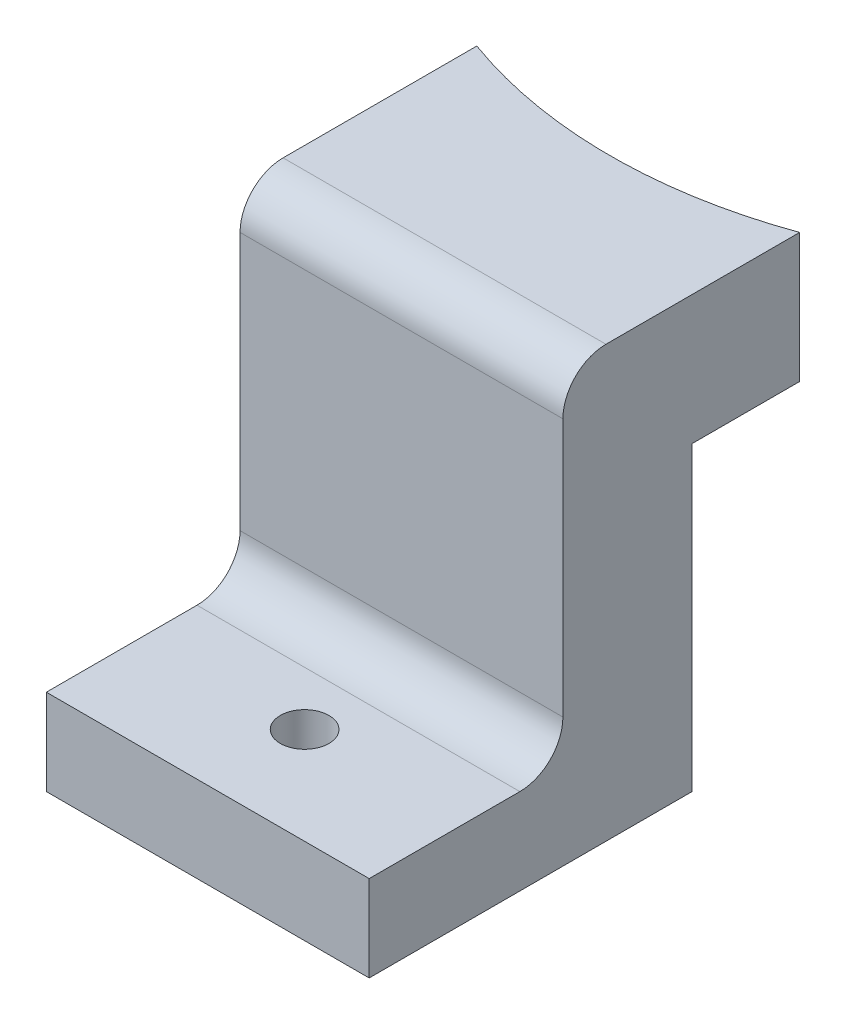
ISO-10303-21;
HEADER;
FILE_DESCRIPTION(('STEP AP214'),'2;1');
FILE_NAME('part.step','',(''),(''),'','','');
FILE_SCHEMA(('AUTOMOTIVE_DESIGN { 1 0 10303 214 1 1 1 1 }'));
ENDSEC;
DATA;
#1=APPLICATION_CONTEXT('core data for automotive mechanical design processes');
#2=APPLICATION_PROTOCOL_DEFINITION('international standard','automotive_design',2000,#1);
#3=PRODUCT_CONTEXT('',#1,'mechanical');
#4=PRODUCT('Part','Part','',(#3));
#5=PRODUCT_RELATED_PRODUCT_CATEGORY('part','',(#4));
#6=PRODUCT_DEFINITION_FORMATION('','',#4);
#7=PRODUCT_DEFINITION_CONTEXT('part definition',#1,'design');
#8=PRODUCT_DEFINITION('design','',#6,#7);
#9=PRODUCT_DEFINITION_SHAPE('','',#8);
#10=(LENGTH_UNIT() NAMED_UNIT(*) SI_UNIT(.MILLI.,.METRE.));
#11=(NAMED_UNIT(*) PLANE_ANGLE_UNIT() SI_UNIT($,.RADIAN.));
#12=(NAMED_UNIT(*) SI_UNIT($,.STERADIAN.) SOLID_ANGLE_UNIT());
#13=UNCERTAINTY_MEASURE_WITH_UNIT(LENGTH_MEASURE(1.E-05),#10,'distance_accuracy_value','');
#14=(GEOMETRIC_REPRESENTATION_CONTEXT(3) GLOBAL_UNCERTAINTY_ASSIGNED_CONTEXT((#13)) GLOBAL_UNIT_ASSIGNED_CONTEXT((#10,
#11,#12)) REPRESENTATION_CONTEXT('',''));
#15=CARTESIAN_POINT('',(0.,0.,0.));
#16=DIRECTION('',(0.,0.,1.));
#17=DIRECTION('',(1.,0.,0.));
#18=AXIS2_PLACEMENT_3D('',#15,#16,#17);
#19=CARTESIAN_POINT('',(-7.5,6.,-5.));
#20=DIRECTION('',(1.,0.,0.));
#21=DIRECTION('',(0.,0.,-1.));
#22=AXIS2_PLACEMENT_3D('',#19,#20,#21);
#23=PLANE('',#22);
#24=DIRECTION('',(0.,1.,0.));
#25=VECTOR('',#24,1.);
#26=CARTESIAN_POINT('',(-7.50000000000001,-14.,6.));
#27=LINE('',#26,#25);
#28=CARTESIAN_POINT('',(-7.50000000000001,-8.,6.));
#29=VERTEX_POINT('',#28);
#30=CARTESIAN_POINT('',(-7.50000000000001,4.,6.));
#31=VERTEX_POINT('',#30);
#32=EDGE_CURVE('E156',#29,#31,#27,.T.);
#33=ORIENTED_EDGE('',*,*,#32,.T.);
#34=CARTESIAN_POINT('',(-7.5,4.,4.));
#35=DIRECTION('',(1.,0.,0.));
#36=DIRECTION('',(0.,0.,-1.));
#37=AXIS2_PLACEMENT_3D('',#34,#35,#36);
#38=CIRCLE('',#37,2.);
#39=CARTESIAN_POINT('',(-7.5,6.,4.));
#40=VERTEX_POINT('',#39);
#41=EDGE_CURVE('E60',#31,#40,#38,.F.);
#42=ORIENTED_EDGE('',*,*,#41,.T.);
#43=DIRECTION('',(0.,0.,1.));
#44=VECTOR('',#43,1.);
#45=CARTESIAN_POINT('',(-7.5,6.,-5.));
#46=LINE('',#45,#44);
#47=CARTESIAN_POINT('',(-7.5,6.,-5.));
#48=VERTEX_POINT('',#47);
#49=EDGE_CURVE('E168',#48,#40,#46,.T.);
#50=ORIENTED_EDGE('',*,*,#49,.F.);
#51=DIRECTION('',(0.,-1.,0.));
#52=VECTOR('',#51,1.);
#53=CARTESIAN_POINT('',(-7.5,6.,-5.));
#54=LINE('',#53,#52);
#55=CARTESIAN_POINT('',(-7.5,0.,-5.));
#56=VERTEX_POINT('',#55);
#57=EDGE_CURVE('E173',#48,#56,#54,.T.);
#58=ORIENTED_EDGE('',*,*,#57,.T.);
#59=DIRECTION('',(0.,0.,1.));
#60=VECTOR('',#59,1.);
#61=CARTESIAN_POINT('',(-7.5,0.,-5.));
#62=LINE('',#61,#60);
#63=CARTESIAN_POINT('',(-7.50000000000001,0.,0.));
#64=VERTEX_POINT('',#63);
#65=EDGE_CURVE('E167',#56,#64,#62,.T.);
#66=ORIENTED_EDGE('',*,*,#65,.T.);
#67=DIRECTION('',(0.,1.,0.));
#68=VECTOR('',#67,1.);
#69=CARTESIAN_POINT('',(-7.50000000000001,-14.,0.));
#70=LINE('',#69,#68);
#71=CARTESIAN_POINT('',(-7.50000000000001,-14.,0.));
#72=VERTEX_POINT('',#71);
#73=EDGE_CURVE('E121',#72,#64,#70,.T.);
#74=ORIENTED_EDGE('',*,*,#73,.F.);
#75=DIRECTION('',(0.,0.,1.));
#76=VECTOR('',#75,1.);
#77=CARTESIAN_POINT('',(-7.50000000000001,-14.,0.));
#78=LINE('',#77,#76);
#79=CARTESIAN_POINT('',(-7.50000000000001,-14.,15.));
#80=VERTEX_POINT('',#79);
#81=EDGE_CURVE('E115',#72,#80,#78,.T.);
#82=ORIENTED_EDGE('',*,*,#81,.T.);
#83=DIRECTION('',(0.,-1.,0.));
#84=VECTOR('',#83,1.);
#85=CARTESIAN_POINT('',(-7.50000000000001,-10.,15.));
#86=LINE('',#85,#84);
#87=CARTESIAN_POINT('',(-7.50000000000001,-10.,15.));
#88=VERTEX_POINT('',#87);
#89=EDGE_CURVE('E119',#88,#80,#86,.T.);
#90=ORIENTED_EDGE('',*,*,#89,.F.);
#91=DIRECTION('',(0.,0.,-1.));
#92=VECTOR('',#91,1.);
#93=CARTESIAN_POINT('',(-7.50000000000001,-10.,15.));
#94=LINE('',#93,#92);
#95=CARTESIAN_POINT('',(-7.50000000000001,-10.,8.));
#96=VERTEX_POINT('',#95);
#97=EDGE_CURVE('E149',#88,#96,#94,.T.);
#98=ORIENTED_EDGE('',*,*,#97,.T.);
#99=CARTESIAN_POINT('',(-7.5,-8.,8.));
#100=DIRECTION('',(1.,0.,0.));
#101=DIRECTION('',(0.,0.,-1.));
#102=AXIS2_PLACEMENT_3D('',#99,#100,#101);
#103=CIRCLE('',#102,2.);
#104=EDGE_CURVE('E45',#96,#29,#103,.T.);
#105=ORIENTED_EDGE('',*,*,#104,.T.);
#106=EDGE_LOOP('',(#33,#42,#50,#58,#66,#74,#82,#90,#98,#105));
#107=FACE_BOUND('',#106,.T.);
#108=ADVANCED_FACE('F37',(#107),#23,.F.);
#109=CARTESIAN_POINT('',(7.5,6.,-5.));
#110=DIRECTION('',(-1.,0.,0.));
#111=DIRECTION('',(0.,0.,1.));
#112=AXIS2_PLACEMENT_3D('',#109,#110,#111);
#113=PLANE('',#112);
#114=DIRECTION('',(0.,0.,-1.));
#115=VECTOR('',#114,1.);
#116=CARTESIAN_POINT('',(7.5,6.,-5.));
#117=LINE('',#116,#115);
#118=CARTESIAN_POINT('',(7.5,6.,4.));
#119=VERTEX_POINT('',#118);
#120=CARTESIAN_POINT('',(7.5,6.,-5.));
#121=VERTEX_POINT('',#120);
#122=EDGE_CURVE('E170',#119,#121,#117,.T.);
#123=ORIENTED_EDGE('',*,*,#122,.F.);
#124=CARTESIAN_POINT('',(7.5,4.,4.));
#125=DIRECTION('',(-1.,0.,0.));
#126=DIRECTION('',(0.,0.,1.));
#127=AXIS2_PLACEMENT_3D('',#124,#125,#126);
#128=CIRCLE('',#127,2.);
#129=CARTESIAN_POINT('',(7.5,4.,6.));
#130=VERTEX_POINT('',#129);
#131=EDGE_CURVE('E52',#119,#130,#128,.F.);
#132=ORIENTED_EDGE('',*,*,#131,.T.);
#133=DIRECTION('',(0.,1.,0.));
#134=VECTOR('',#133,1.);
#135=CARTESIAN_POINT('',(7.5,-14.,6.));
#136=LINE('',#135,#134);
#137=CARTESIAN_POINT('',(7.5,-8.,6.));
#138=VERTEX_POINT('',#137);
#139=EDGE_CURVE('E161',#138,#130,#136,.T.);
#140=ORIENTED_EDGE('',*,*,#139,.F.);
#141=CARTESIAN_POINT('',(7.5,-8.,8.));
#142=DIRECTION('',(-1.,0.,0.));
#143=DIRECTION('',(0.,0.,1.));
#144=AXIS2_PLACEMENT_3D('',#141,#142,#143);
#145=CIRCLE('',#144,2.);
#146=CARTESIAN_POINT('',(7.5,-10.,8.));
#147=VERTEX_POINT('',#146);
#148=EDGE_CURVE('E11',#138,#147,#145,.T.);
#149=ORIENTED_EDGE('',*,*,#148,.T.);
#150=DIRECTION('',(0.,0.,-1.));
#151=VECTOR('',#150,1.);
#152=CARTESIAN_POINT('',(7.5,-10.,15.));
#153=LINE('',#152,#151);
#154=CARTESIAN_POINT('',(7.5,-10.,15.));
#155=VERTEX_POINT('',#154);
#156=EDGE_CURVE('E126',#155,#147,#153,.T.);
#157=ORIENTED_EDGE('',*,*,#156,.F.);
#158=DIRECTION('',(0.,1.,0.));
#159=VECTOR('',#158,1.);
#160=CARTESIAN_POINT('',(7.5,-10.,15.));
#161=LINE('',#160,#159);
#162=CARTESIAN_POINT('',(7.5,-14.,15.));
#163=VERTEX_POINT('',#162);
#164=EDGE_CURVE('E134',#163,#155,#161,.T.);
#165=ORIENTED_EDGE('',*,*,#164,.F.);
#166=DIRECTION('',(0.,0.,-1.));
#167=VECTOR('',#166,1.);
#168=CARTESIAN_POINT('',(7.5,-14.,0.));
#169=LINE('',#168,#167);
#170=CARTESIAN_POINT('',(7.5,-14.,0.));
#171=VERTEX_POINT('',#170);
#172=EDGE_CURVE('E125',#163,#171,#169,.T.);
#173=ORIENTED_EDGE('',*,*,#172,.T.);
#174=DIRECTION('',(0.,1.,0.));
#175=VECTOR('',#174,1.);
#176=CARTESIAN_POINT('',(7.5,-14.,0.));
#177=LINE('',#176,#175);
#178=CARTESIAN_POINT('',(7.5,0.,0.));
#179=VERTEX_POINT('',#178);
#180=EDGE_CURVE('E159',#171,#179,#177,.T.);
#181=ORIENTED_EDGE('',*,*,#180,.T.);
#182=DIRECTION('',(0.,0.,-1.));
#183=VECTOR('',#182,1.);
#184=CARTESIAN_POINT('',(7.5,0.,-5.));
#185=LINE('',#184,#183);
#186=CARTESIAN_POINT('',(7.5,0.,-5.));
#187=VERTEX_POINT('',#186);
#188=EDGE_CURVE('E171',#179,#187,#185,.T.);
#189=ORIENTED_EDGE('',*,*,#188,.T.);
#190=DIRECTION('',(0.,-1.,0.));
#191=VECTOR('',#190,1.);
#192=CARTESIAN_POINT('',(7.5,6.,-5.));
#193=LINE('',#192,#191);
#194=EDGE_CURVE('E178',#121,#187,#193,.T.);
#195=ORIENTED_EDGE('',*,*,#194,.F.);
#196=EDGE_LOOP('',(#123,#132,#140,#149,#157,#165,#173,#181,#189,#195));
#197=FACE_BOUND('',#196,.T.);
#198=ADVANCED_FACE('F209',(#197),#113,.F.);
#199=CARTESIAN_POINT('',(0.,6.,0.));
#200=DIRECTION('',(0.,1.,0.));
#201=DIRECTION('',(0.,0.,1.));
#202=AXIS2_PLACEMENT_3D('',#199,#200,#201);
#203=PLANE('',#202);
#204=ORIENTED_EDGE('',*,*,#49,.T.);
#205=DIRECTION('',(1.,0.,0.));
#206=VECTOR('',#205,1.);
#207=CARTESIAN_POINT('',(0.,6.,4.));
#208=LINE('',#207,#206);
#209=EDGE_CURVE('E194',#40,#119,#208,.T.);
#210=ORIENTED_EDGE('',*,*,#209,.T.);
#211=ORIENTED_EDGE('',*,*,#122,.T.);
#212=CARTESIAN_POINT('',(0.,6.,-25.6821178799464));
#213=DIRECTION('',(0.,1.,0.));
#214=DIRECTION('',(0.,0.,1.));
#215=AXIS2_PLACEMENT_3D('',#212,#213,#214);
#216=CIRCLE('',#215,22.);
#217=EDGE_CURVE('E158',#48,#121,#216,.T.);
#218=ORIENTED_EDGE('',*,*,#217,.F.);
#219=EDGE_LOOP('',(#204,#210,#211,#218));
#220=FACE_BOUND('',#219,.T.);
#221=ADVANCED_FACE('F228',(#220),#203,.T.);
#222=CARTESIAN_POINT('',(0.,0.,0.));
#223=DIRECTION('',(0.,1.,0.));
#224=DIRECTION('',(0.,0.,1.));
#225=AXIS2_PLACEMENT_3D('',#222,#223,#224);
#226=PLANE('',#225);
#227=ORIENTED_EDGE('',*,*,#188,.F.);
#228=DIRECTION('',(-1.,0.,0.));
#229=VECTOR('',#228,1.);
#230=CARTESIAN_POINT('',(0.,0.,0.));
#231=LINE('',#230,#229);
#232=EDGE_CURVE('E184',#179,#64,#231,.T.);
#233=ORIENTED_EDGE('',*,*,#232,.T.);
#234=ORIENTED_EDGE('',*,*,#65,.F.);
#235=CARTESIAN_POINT('',(0.,0.,-25.6821178799464));
#236=DIRECTION('',(0.,1.,0.));
#237=DIRECTION('',(0.,0.,1.));
#238=AXIS2_PLACEMENT_3D('',#235,#236,#237);
#239=CIRCLE('',#238,22.);
#240=EDGE_CURVE('E181',#56,#187,#239,.T.);
#241=ORIENTED_EDGE('',*,*,#240,.T.);
#242=EDGE_LOOP('',(#227,#233,#234,#241));
#243=FACE_BOUND('',#242,.T.);
#244=ADVANCED_FACE('F293',(#243),#226,.F.);
#245=CARTESIAN_POINT('',(0.,-3.,-25.6821178799464));
#246=DIRECTION('',(0.,1.,0.));
#247=DIRECTION('',(0.,0.,1.));
#248=AXIS2_PLACEMENT_3D('',#245,#246,#247);
#249=CYLINDRICAL_SURFACE('',#248,22.);
#250=ORIENTED_EDGE('',*,*,#240,.F.);
#251=ORIENTED_EDGE('',*,*,#57,.F.);
#252=ORIENTED_EDGE('',*,*,#217,.T.);
#253=ORIENTED_EDGE('',*,*,#194,.T.);
#254=EDGE_LOOP('',(#250,#251,#252,#253));
#255=FACE_BOUND('',#254,.T.);
#256=ADVANCED_FACE('F324',(#255),#249,.F.);
#257=CARTESIAN_POINT('',(-7.50000000000001,-14.,0.));
#258=DIRECTION('',(0.,0.,-1.));
#259=DIRECTION('',(-1.,0.,0.));
#260=AXIS2_PLACEMENT_3D('',#257,#258,#259);
#261=PLANE('',#260);
#262=ORIENTED_EDGE('',*,*,#232,.F.);
#263=ORIENTED_EDGE('',*,*,#180,.F.);
#264=DIRECTION('',(-1.,0.,0.));
#265=VECTOR('',#264,1.);
#266=CARTESIAN_POINT('',(-7.50000000000001,-14.,0.));
#267=LINE('',#266,#265);
#268=EDGE_CURVE('E154',#171,#72,#267,.T.);
#269=ORIENTED_EDGE('',*,*,#268,.T.);
#270=ORIENTED_EDGE('',*,*,#73,.T.);
#271=EDGE_LOOP('',(#262,#263,#269,#270));
#272=FACE_BOUND('',#271,.T.);
#273=ADVANCED_FACE('F257',(#272),#261,.T.);
#274=CARTESIAN_POINT('',(-7.50000000000001,-14.,6.));
#275=DIRECTION('',(0.,0.,1.));
#276=DIRECTION('',(1.,0.,0.));
#277=AXIS2_PLACEMENT_3D('',#274,#275,#276);
#278=PLANE('',#277);
#279=ORIENTED_EDGE('',*,*,#32,.F.);
#280=DIRECTION('',(-1.,0.,0.));
#281=VECTOR('',#280,1.);
#282=CARTESIAN_POINT('',(-7.50000000000001,-8.,6.));
#283=LINE('',#282,#281);
#284=EDGE_CURVE('E192',#29,#138,#283,.F.);
#285=ORIENTED_EDGE('',*,*,#284,.T.);
#286=ORIENTED_EDGE('',*,*,#139,.T.);
#287=DIRECTION('',(1.,0.,0.));
#288=VECTOR('',#287,1.);
#289=CARTESIAN_POINT('',(-7.50000000000001,4.,6.));
#290=LINE('',#289,#288);
#291=EDGE_CURVE('E190',#130,#31,#290,.F.);
#292=ORIENTED_EDGE('',*,*,#291,.T.);
#293=EDGE_LOOP('',(#279,#285,#286,#292));
#294=FACE_BOUND('',#293,.T.);
#295=ADVANCED_FACE('F202',(#294),#278,.T.);
#296=CARTESIAN_POINT('',(0.,-14.,0.));
#297=DIRECTION('',(0.,1.,0.));
#298=DIRECTION('',(0.,0.,1.));
#299=AXIS2_PLACEMENT_3D('',#296,#297,#298);
#300=PLANE('',#299);
#301=CARTESIAN_POINT('',(0.,-14.,10.5));
#302=DIRECTION('',(0.,-1.,0.));
#303=DIRECTION('',(0.,0.,-1.));
#304=AXIS2_PLACEMENT_3D('',#301,#302,#303);
#305=CIRCLE('',#304,1.13029999999999);
#306=CARTESIAN_POINT('',(0.,-14.,9.36970000000001));
#307=VERTEX_POINT('',#306);
#308=EDGE_CURVE('E143',#307,#307,#305,.T.);
#309=ORIENTED_EDGE('',*,*,#308,.F.);
#310=EDGE_LOOP('',(#309));
#311=FACE_BOUND('',#310,.T.);
#312=ORIENTED_EDGE('',*,*,#81,.F.);
#313=ORIENTED_EDGE('',*,*,#268,.F.);
#314=ORIENTED_EDGE('',*,*,#172,.F.);
#315=DIRECTION('',(1.,0.,0.));
#316=VECTOR('',#315,1.);
#317=CARTESIAN_POINT('',(-7.50000000000001,-14.,15.));
#318=LINE('',#317,#316);
#319=EDGE_CURVE('E129',#80,#163,#318,.T.);
#320=ORIENTED_EDGE('',*,*,#319,.F.);
#321=EDGE_LOOP('',(#312,#313,#314,#320));
#322=FACE_BOUND('',#321,.T.);
#323=ADVANCED_FACE('F130',(#311,#322),#300,.F.);
#324=CARTESIAN_POINT('',(-7.50000000000001,-10.,15.));
#325=DIRECTION('',(0.,-1.,0.));
#326=DIRECTION('',(0.,0.,-1.));
#327=AXIS2_PLACEMENT_3D('',#324,#325,#326);
#328=PLANE('',#327);
#329=CARTESIAN_POINT('',(0.,-10.,10.5));
#330=DIRECTION('',(0.,-1.,0.));
#331=DIRECTION('',(0.,0.,-1.));
#332=AXIS2_PLACEMENT_3D('',#329,#330,#331);
#333=CIRCLE('',#332,1.13029999999999);
#334=CARTESIAN_POINT('',(0.,-10.,9.36970000000001));
#335=VERTEX_POINT('',#334);
#336=EDGE_CURVE('E140',#335,#335,#333,.T.);
#337=ORIENTED_EDGE('',*,*,#336,.T.);
#338=EDGE_LOOP('',(#337));
#339=FACE_BOUND('',#338,.T.);
#340=ORIENTED_EDGE('',*,*,#156,.T.);
#341=DIRECTION('',(-1.,0.,0.));
#342=VECTOR('',#341,1.);
#343=CARTESIAN_POINT('',(-7.50000000000001,-10.,8.));
#344=LINE('',#343,#342);
#345=EDGE_CURVE('E187',#147,#96,#344,.T.);
#346=ORIENTED_EDGE('',*,*,#345,.T.);
#347=ORIENTED_EDGE('',*,*,#97,.F.);
#348=DIRECTION('',(-1.,0.,0.));
#349=VECTOR('',#348,1.);
#350=CARTESIAN_POINT('',(-7.50000000000001,-10.,15.));
#351=LINE('',#350,#349);
#352=EDGE_CURVE('E138',#155,#88,#351,.T.);
#353=ORIENTED_EDGE('',*,*,#352,.F.);
#354=EDGE_LOOP('',(#340,#346,#347,#353));
#355=FACE_BOUND('',#354,.T.);
#356=ADVANCED_FACE('F211',(#339,#355),#328,.F.);
#357=CARTESIAN_POINT('',(0.,0.,15.));
#358=DIRECTION('',(0.,0.,1.));
#359=DIRECTION('',(1.,0.,0.));
#360=AXIS2_PLACEMENT_3D('',#357,#358,#359);
#361=PLANE('',#360);
#362=ORIENTED_EDGE('',*,*,#89,.T.);
#363=ORIENTED_EDGE('',*,*,#319,.T.);
#364=ORIENTED_EDGE('',*,*,#164,.T.);
#365=ORIENTED_EDGE('',*,*,#352,.T.);
#366=EDGE_LOOP('',(#362,#363,#364,#365));
#367=FACE_BOUND('',#366,.T.);
#368=ADVANCED_FACE('F136',(#367),#361,.T.);
#369=CARTESIAN_POINT('',(0.,-14.,10.5));
#370=DIRECTION('',(0.,-1.,0.));
#371=DIRECTION('',(0.,0.,-1.));
#372=AXIS2_PLACEMENT_3D('',#369,#370,#371);
#373=CYLINDRICAL_SURFACE('',#372,1.13029999999999);
#374=ORIENTED_EDGE('',*,*,#308,.T.);
#375=EDGE_LOOP('',(#374));
#376=FACE_BOUND('',#375,.T.);
#377=ORIENTED_EDGE('',*,*,#336,.F.);
#378=EDGE_LOOP('',(#377));
#379=FACE_BOUND('',#378,.T.);
#380=ADVANCED_FACE('F219',(#376,#379),#373,.F.);
#381=CARTESIAN_POINT('',(-7.50000000000001,-8.,8.));
#382=DIRECTION('',(-1.,0.,0.));
#383=DIRECTION('',(0.,0.,1.));
#384=AXIS2_PLACEMENT_3D('',#381,#382,#383);
#385=CYLINDRICAL_SURFACE('',#384,2.);
#386=ORIENTED_EDGE('',*,*,#148,.F.);
#387=ORIENTED_EDGE('',*,*,#284,.F.);
#388=ORIENTED_EDGE('',*,*,#104,.F.);
#389=ORIENTED_EDGE('',*,*,#345,.F.);
#390=EDGE_LOOP('',(#386,#387,#388,#389));
#391=FACE_BOUND('',#390,.T.);
#392=ADVANCED_FACE('F205',(#391),#385,.F.);
#393=CARTESIAN_POINT('',(0.,4.,4.));
#394=DIRECTION('',(1.,0.,0.));
#395=DIRECTION('',(0.,0.,-1.));
#396=AXIS2_PLACEMENT_3D('',#393,#394,#395);
#397=CYLINDRICAL_SURFACE('',#396,2.);
#398=ORIENTED_EDGE('',*,*,#41,.F.);
#399=ORIENTED_EDGE('',*,*,#291,.F.);
#400=ORIENTED_EDGE('',*,*,#131,.F.);
#401=ORIENTED_EDGE('',*,*,#209,.F.);
#402=EDGE_LOOP('',(#398,#399,#400,#401));
#403=FACE_BOUND('',#402,.T.);
#404=ADVANCED_FACE('F39',(#403),#397,.T.);
#405=CLOSED_SHELL('',(#108,#198,#221,#244,#256,#273,#295,#323,#356,#368,#380,#392,#404));
#406=MANIFOLD_SOLID_BREP('B2',#405);
#407=ADVANCED_BREP_SHAPE_REPRESENTATION('',(#18,#406),#14);
#408=SHAPE_DEFINITION_REPRESENTATION(#9,#407);
ENDSEC;
END-ISO-10303-21;
